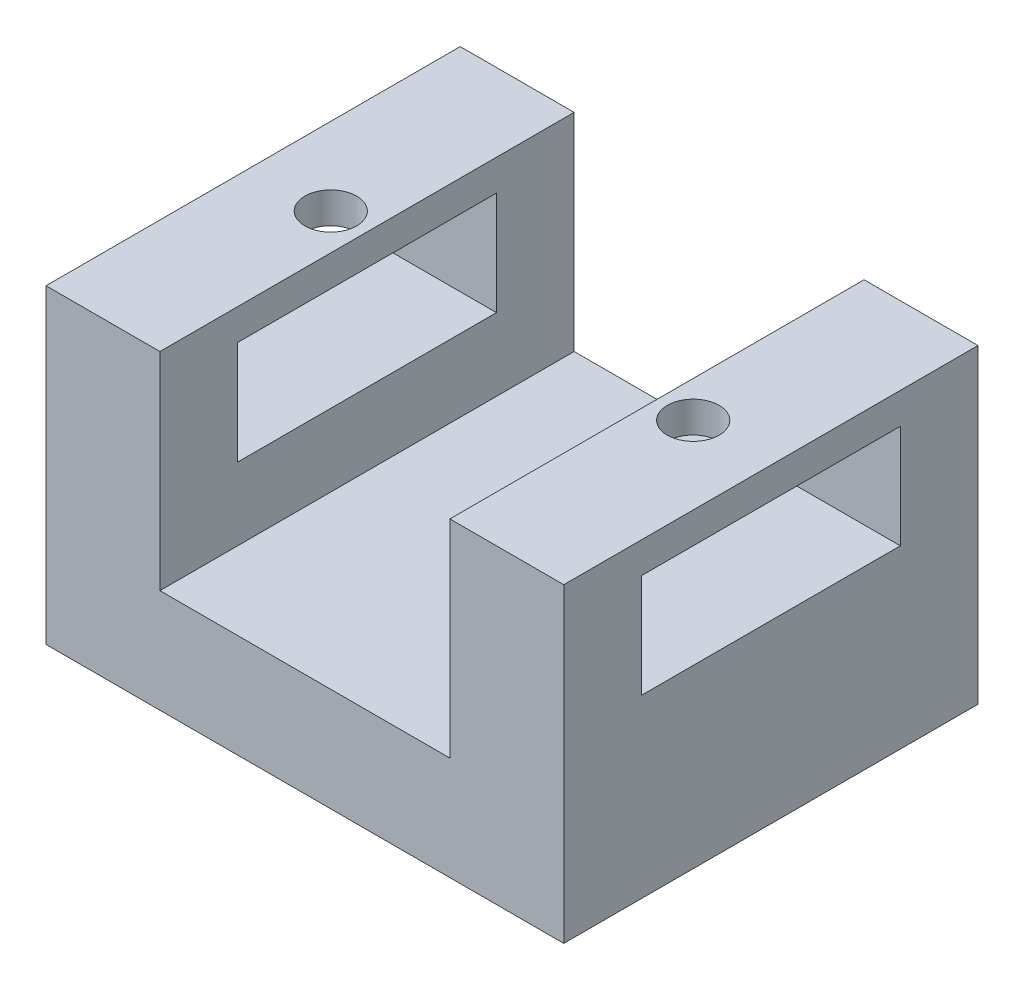
ISO-10303-21;
HEADER;
FILE_DESCRIPTION(('STEP AP214'),'2;1');
FILE_NAME('part.step','',(''),(''),'','','');
FILE_SCHEMA(('AUTOMOTIVE_DESIGN { 1 0 10303 214 1 1 1 1 }'));
ENDSEC;
DATA;
#1=APPLICATION_CONTEXT('core data for automotive mechanical design processes');
#2=APPLICATION_PROTOCOL_DEFINITION('international standard','automotive_design',2000,#1);
#3=PRODUCT_CONTEXT('',#1,'mechanical');
#4=PRODUCT('Part','Part','',(#3));
#5=PRODUCT_RELATED_PRODUCT_CATEGORY('part','',(#4));
#6=PRODUCT_DEFINITION_FORMATION('','',#4);
#7=PRODUCT_DEFINITION_CONTEXT('part definition',#1,'design');
#8=PRODUCT_DEFINITION('design','',#6,#7);
#9=PRODUCT_DEFINITION_SHAPE('','',#8);
#10=(LENGTH_UNIT() NAMED_UNIT(*) SI_UNIT(.MILLI.,.METRE.));
#11=(NAMED_UNIT(*) PLANE_ANGLE_UNIT() SI_UNIT($,.RADIAN.));
#12=(NAMED_UNIT(*) SI_UNIT($,.STERADIAN.) SOLID_ANGLE_UNIT());
#13=UNCERTAINTY_MEASURE_WITH_UNIT(LENGTH_MEASURE(1.E-05),#10,'distance_accuracy_value','');
#14=(GEOMETRIC_REPRESENTATION_CONTEXT(3) GLOBAL_UNCERTAINTY_ASSIGNED_CONTEXT((#13)) GLOBAL_UNIT_ASSIGNED_CONTEXT((#10,
#11,#12)) REPRESENTATION_CONTEXT('',''));
#15=CARTESIAN_POINT('',(0.,0.,0.));
#16=DIRECTION('',(0.,0.,1.));
#17=DIRECTION('',(1.,0.,0.));
#18=AXIS2_PLACEMENT_3D('',#15,#16,#17);
#19=CARTESIAN_POINT('',(0.,10.,0.));
#20=DIRECTION('',(0.,-1.,0.));
#21=DIRECTION('',(0.,0.,-1.));
#22=AXIS2_PLACEMENT_3D('',#19,#20,#21);
#23=PLANE('',#22);
#24=DIRECTION('',(1.,0.,0.));
#25=VECTOR('',#24,1.);
#26=CARTESIAN_POINT('',(0.,10.,0.));
#27=LINE('',#26,#25);
#28=CARTESIAN_POINT('',(11.,10.,0.));
#29=VERTEX_POINT('',#28);
#30=CARTESIAN_POINT('',(39.,10.,0.));
#31=VERTEX_POINT('',#30);
#32=EDGE_CURVE('E287',#29,#31,#27,.T.);
#33=ORIENTED_EDGE('',*,*,#32,.T.);
#34=DIRECTION('',(0.,0.,-1.));
#35=VECTOR('',#34,1.);
#36=CARTESIAN_POINT('',(39.,10.,-40.));
#37=LINE('',#36,#35);
#38=CARTESIAN_POINT('',(39.,10.,-40.));
#39=VERTEX_POINT('',#38);
#40=EDGE_CURVE('E232',#31,#39,#37,.T.);
#41=ORIENTED_EDGE('',*,*,#40,.T.);
#42=DIRECTION('',(-1.,0.,0.));
#43=VECTOR('',#42,1.);
#44=CARTESIAN_POINT('',(0.,10.,-40.));
#45=LINE('',#44,#43);
#46=CARTESIAN_POINT('',(11.,10.,-40.));
#47=VERTEX_POINT('',#46);
#48=EDGE_CURVE('E290',#39,#47,#45,.T.);
#49=ORIENTED_EDGE('',*,*,#48,.T.);
#50=DIRECTION('',(0.,0.,-1.));
#51=VECTOR('',#50,1.);
#52=CARTESIAN_POINT('',(11.,10.,-40.));
#53=LINE('',#52,#51);
#54=EDGE_CURVE('E260',#29,#47,#53,.T.);
#55=ORIENTED_EDGE('',*,*,#54,.F.);
#56=EDGE_LOOP('',(#33,#41,#49,#55));
#57=FACE_BOUND('',#56,.T.);
#58=ADVANCED_FACE('F43',(#57),#23,.F.);
#59=CARTESIAN_POINT('',(0.,10.,0.));
#60=DIRECTION('',(1.,0.,0.));
#61=DIRECTION('',(0.,0.,-1.));
#62=AXIS2_PLACEMENT_3D('',#59,#60,#61);
#63=PLANE('',#62);
#64=DIRECTION('',(0.,0.,1.));
#65=VECTOR('',#64,1.);
#66=CARTESIAN_POINT('',(0.,27.,-7.5));
#67=LINE('',#66,#65);
#68=CARTESIAN_POINT('',(0.,27.,-32.5));
#69=VERTEX_POINT('',#68);
#70=CARTESIAN_POINT('',(0.,27.,-7.5));
#71=VERTEX_POINT('',#70);
#72=EDGE_CURVE('E183',#69,#71,#67,.T.);
#73=ORIENTED_EDGE('',*,*,#72,.T.);
#74=DIRECTION('',(0.,-1.,0.));
#75=VECTOR('',#74,1.);
#76=CARTESIAN_POINT('',(0.,27.,-7.5));
#77=LINE('',#76,#75);
#78=CARTESIAN_POINT('',(0.,17.,-7.5));
#79=VERTEX_POINT('',#78);
#80=EDGE_CURVE('E164',#71,#79,#77,.T.);
#81=ORIENTED_EDGE('',*,*,#80,.T.);
#82=DIRECTION('',(0.,0.,-1.));
#83=VECTOR('',#82,1.);
#84=CARTESIAN_POINT('',(0.,17.,-7.5));
#85=LINE('',#84,#83);
#86=CARTESIAN_POINT('',(0.,17.,-32.5));
#87=VERTEX_POINT('',#86);
#88=EDGE_CURVE('E175',#79,#87,#85,.T.);
#89=ORIENTED_EDGE('',*,*,#88,.T.);
#90=DIRECTION('',(0.,1.,0.));
#91=VECTOR('',#90,1.);
#92=CARTESIAN_POINT('',(0.,27.,-32.5));
#93=LINE('',#92,#91);
#94=EDGE_CURVE('E60',#87,#69,#93,.T.);
#95=ORIENTED_EDGE('',*,*,#94,.T.);
#96=EDGE_LOOP('',(#73,#81,#89,#95));
#97=FACE_BOUND('',#96,.T.);
#98=DIRECTION('',(0.,0.,1.));
#99=VECTOR('',#98,1.);
#100=CARTESIAN_POINT('',(0.,0.,0.));
#101=LINE('',#100,#99);
#102=CARTESIAN_POINT('',(0.,0.,-40.));
#103=VERTEX_POINT('',#102);
#104=CARTESIAN_POINT('',(0.,0.,0.));
#105=VERTEX_POINT('',#104);
#106=EDGE_CURVE('E286',#103,#105,#101,.T.);
#107=ORIENTED_EDGE('',*,*,#106,.T.);
#108=DIRECTION('',(0.,-1.,0.));
#109=VECTOR('',#108,1.);
#110=CARTESIAN_POINT('',(0.,10.,0.));
#111=LINE('',#110,#109);
#112=CARTESIAN_POINT('',(0.,30.,0.));
#113=VERTEX_POINT('',#112);
#114=EDGE_CURVE('E317',#113,#105,#111,.T.);
#115=ORIENTED_EDGE('',*,*,#114,.F.);
#116=DIRECTION('',(0.,0.,1.));
#117=VECTOR('',#116,1.);
#118=CARTESIAN_POINT('',(0.,30.,-40.));
#119=LINE('',#118,#117);
#120=CARTESIAN_POINT('',(0.,30.,-40.));
#121=VERTEX_POINT('',#120);
#122=EDGE_CURVE('E261',#121,#113,#119,.T.);
#123=ORIENTED_EDGE('',*,*,#122,.F.);
#124=DIRECTION('',(0.,-1.,0.));
#125=VECTOR('',#124,1.);
#126=CARTESIAN_POINT('',(0.,10.,-40.));
#127=LINE('',#126,#125);
#128=EDGE_CURVE('E294',#121,#103,#127,.T.);
#129=ORIENTED_EDGE('',*,*,#128,.T.);
#130=EDGE_LOOP('',(#107,#115,#123,#129));
#131=FACE_BOUND('',#130,.T.);
#132=ADVANCED_FACE('F45',(#97,#131),#63,.F.);
#133=CARTESIAN_POINT('',(0.,10.,0.));
#134=DIRECTION('',(0.,0.,-1.));
#135=DIRECTION('',(-1.,0.,0.));
#136=AXIS2_PLACEMENT_3D('',#133,#134,#135);
#137=PLANE('',#136);
#138=DIRECTION('',(1.,0.,0.));
#139=VECTOR('',#138,1.);
#140=CARTESIAN_POINT('',(0.,0.,0.));
#141=LINE('',#140,#139);
#142=CARTESIAN_POINT('',(50.,0.,0.));
#143=VERTEX_POINT('',#142);
#144=EDGE_CURVE('E298',#105,#143,#141,.T.);
#145=ORIENTED_EDGE('',*,*,#144,.T.);
#146=DIRECTION('',(0.,-1.,0.));
#147=VECTOR('',#146,1.);
#148=CARTESIAN_POINT('',(50.,10.,0.));
#149=LINE('',#148,#147);
#150=CARTESIAN_POINT('',(50.,30.,0.));
#151=VERTEX_POINT('',#150);
#152=EDGE_CURVE('E313',#151,#143,#149,.T.);
#153=ORIENTED_EDGE('',*,*,#152,.F.);
#154=DIRECTION('',(-1.,0.,0.));
#155=VECTOR('',#154,1.);
#156=CARTESIAN_POINT('',(50.,30.,0.));
#157=LINE('',#156,#155);
#158=CARTESIAN_POINT('',(39.,30.,0.));
#159=VERTEX_POINT('',#158);
#160=EDGE_CURVE('E245',#151,#159,#157,.T.);
#161=ORIENTED_EDGE('',*,*,#160,.T.);
#162=DIRECTION('',(0.,-1.,0.));
#163=VECTOR('',#162,1.);
#164=CARTESIAN_POINT('',(39.,30.,0.));
#165=LINE('',#164,#163);
#166=EDGE_CURVE('E249',#159,#31,#165,.T.);
#167=ORIENTED_EDGE('',*,*,#166,.T.);
#168=ORIENTED_EDGE('',*,*,#32,.F.);
#169=DIRECTION('',(0.,-1.,0.));
#170=VECTOR('',#169,1.);
#171=CARTESIAN_POINT('',(11.,30.,0.));
#172=LINE('',#171,#170);
#173=CARTESIAN_POINT('',(11.,30.,0.));
#174=VERTEX_POINT('',#173);
#175=EDGE_CURVE('E282',#174,#29,#172,.T.);
#176=ORIENTED_EDGE('',*,*,#175,.F.);
#177=DIRECTION('',(1.,0.,0.));
#178=VECTOR('',#177,1.);
#179=CARTESIAN_POINT('',(0.,30.,0.));
#180=LINE('',#179,#178);
#181=EDGE_CURVE('E265',#113,#174,#180,.T.);
#182=ORIENTED_EDGE('',*,*,#181,.F.);
#183=ORIENTED_EDGE('',*,*,#114,.T.);
#184=EDGE_LOOP('',(#145,#153,#161,#167,#168,#176,#182,#183));
#185=FACE_BOUND('',#184,.T.);
#186=ADVANCED_FACE('F357',(#185),#137,.F.);
#187=CARTESIAN_POINT('',(50.,10.,0.));
#188=DIRECTION('',(-1.,0.,0.));
#189=DIRECTION('',(0.,0.,1.));
#190=AXIS2_PLACEMENT_3D('',#187,#188,#189);
#191=PLANE('',#190);
#192=DIRECTION('',(0.,0.,-1.));
#193=VECTOR('',#192,1.);
#194=CARTESIAN_POINT('',(50.,17.,-7.5));
#195=LINE('',#194,#193);
#196=CARTESIAN_POINT('',(50.,17.,-7.5));
#197=VERTEX_POINT('',#196);
#198=CARTESIAN_POINT('',(50.,17.,-32.5));
#199=VERTEX_POINT('',#198);
#200=EDGE_CURVE('E201',#197,#199,#195,.T.);
#201=ORIENTED_EDGE('',*,*,#200,.F.);
#202=DIRECTION('',(0.,-1.,0.));
#203=VECTOR('',#202,1.);
#204=CARTESIAN_POINT('',(50.,27.,-7.5));
#205=LINE('',#204,#203);
#206=CARTESIAN_POINT('',(50.,27.,-7.5));
#207=VERTEX_POINT('',#206);
#208=EDGE_CURVE('E68',#207,#197,#205,.T.);
#209=ORIENTED_EDGE('',*,*,#208,.F.);
#210=DIRECTION('',(0.,0.,1.));
#211=VECTOR('',#210,1.);
#212=CARTESIAN_POINT('',(50.,27.,-7.5));
#213=LINE('',#212,#211);
#214=CARTESIAN_POINT('',(50.,27.,-32.5));
#215=VERTEX_POINT('',#214);
#216=EDGE_CURVE('E185',#215,#207,#213,.T.);
#217=ORIENTED_EDGE('',*,*,#216,.F.);
#218=DIRECTION('',(0.,1.,0.));
#219=VECTOR('',#218,1.);
#220=CARTESIAN_POINT('',(50.,27.,-32.5));
#221=LINE('',#220,#219);
#222=EDGE_CURVE('E189',#199,#215,#221,.T.);
#223=ORIENTED_EDGE('',*,*,#222,.F.);
#224=EDGE_LOOP('',(#201,#209,#217,#223));
#225=FACE_BOUND('',#224,.T.);
#226=DIRECTION('',(0.,0.,-1.));
#227=VECTOR('',#226,1.);
#228=CARTESIAN_POINT('',(50.,0.,0.));
#229=LINE('',#228,#227);
#230=CARTESIAN_POINT('',(50.,0.,-40.));
#231=VERTEX_POINT('',#230);
#232=EDGE_CURVE('E301',#143,#231,#229,.T.);
#233=ORIENTED_EDGE('',*,*,#232,.T.);
#234=DIRECTION('',(0.,-1.,0.));
#235=VECTOR('',#234,1.);
#236=CARTESIAN_POINT('',(50.,10.,-40.));
#237=LINE('',#236,#235);
#238=CARTESIAN_POINT('',(50.,30.,-40.));
#239=VERTEX_POINT('',#238);
#240=EDGE_CURVE('E309',#239,#231,#237,.T.);
#241=ORIENTED_EDGE('',*,*,#240,.F.);
#242=DIRECTION('',(0.,0.,1.));
#243=VECTOR('',#242,1.);
#244=CARTESIAN_POINT('',(50.,30.,-40.));
#245=LINE('',#244,#243);
#246=EDGE_CURVE('E233',#239,#151,#245,.T.);
#247=ORIENTED_EDGE('',*,*,#246,.T.);
#248=ORIENTED_EDGE('',*,*,#152,.T.);
#249=EDGE_LOOP('',(#233,#241,#247,#248));
#250=FACE_BOUND('',#249,.T.);
#251=ADVANCED_FACE('F353',(#225,#250),#191,.F.);
#252=CARTESIAN_POINT('',(0.,10.,-40.));
#253=DIRECTION('',(0.,0.,1.));
#254=DIRECTION('',(1.,0.,0.));
#255=AXIS2_PLACEMENT_3D('',#252,#253,#254);
#256=PLANE('',#255);
#257=DIRECTION('',(-1.,0.,0.));
#258=VECTOR('',#257,1.);
#259=CARTESIAN_POINT('',(0.,0.,-40.));
#260=LINE('',#259,#258);
#261=EDGE_CURVE('E291',#231,#103,#260,.T.);
#262=ORIENTED_EDGE('',*,*,#261,.T.);
#263=ORIENTED_EDGE('',*,*,#128,.F.);
#264=DIRECTION('',(-1.,0.,0.));
#265=VECTOR('',#264,1.);
#266=CARTESIAN_POINT('',(0.,30.,-40.));
#267=LINE('',#266,#265);
#268=CARTESIAN_POINT('',(11.,30.,-40.));
#269=VERTEX_POINT('',#268);
#270=EDGE_CURVE('E271',#269,#121,#267,.T.);
#271=ORIENTED_EDGE('',*,*,#270,.F.);
#272=DIRECTION('',(0.,-1.,0.));
#273=VECTOR('',#272,1.);
#274=CARTESIAN_POINT('',(11.,30.,-40.));
#275=LINE('',#274,#273);
#276=EDGE_CURVE('E275',#269,#47,#275,.T.);
#277=ORIENTED_EDGE('',*,*,#276,.T.);
#278=ORIENTED_EDGE('',*,*,#48,.F.);
#279=DIRECTION('',(0.,-1.,0.));
#280=VECTOR('',#279,1.);
#281=CARTESIAN_POINT('',(39.,30.,-40.));
#282=LINE('',#281,#280);
#283=CARTESIAN_POINT('',(39.,30.,-40.));
#284=VERTEX_POINT('',#283);
#285=EDGE_CURVE('E256',#284,#39,#282,.T.);
#286=ORIENTED_EDGE('',*,*,#285,.F.);
#287=DIRECTION('',(1.,0.,0.));
#288=VECTOR('',#287,1.);
#289=CARTESIAN_POINT('',(50.,30.,-40.));
#290=LINE('',#289,#288);
#291=EDGE_CURVE('E237',#284,#239,#290,.T.);
#292=ORIENTED_EDGE('',*,*,#291,.T.);
#293=ORIENTED_EDGE('',*,*,#240,.T.);
#294=EDGE_LOOP('',(#262,#263,#271,#277,#278,#286,#292,#293));
#295=FACE_BOUND('',#294,.T.);
#296=ADVANCED_FACE('F356',(#295),#256,.F.);
#297=CARTESIAN_POINT('',(0.,0.,0.));
#298=DIRECTION('',(0.,-1.,0.));
#299=DIRECTION('',(0.,0.,-1.));
#300=AXIS2_PLACEMENT_3D('',#297,#298,#299);
#301=PLANE('',#300);
#302=ORIENTED_EDGE('',*,*,#106,.F.);
#303=ORIENTED_EDGE('',*,*,#261,.F.);
#304=ORIENTED_EDGE('',*,*,#232,.F.);
#305=ORIENTED_EDGE('',*,*,#144,.F.);
#306=EDGE_LOOP('',(#302,#303,#304,#305));
#307=FACE_BOUND('',#306,.T.);
#308=ADVANCED_FACE('F366',(#307),#301,.T.);
#309=CARTESIAN_POINT('',(11.,30.,-40.));
#310=DIRECTION('',(-1.,0.,0.));
#311=DIRECTION('',(0.,0.,1.));
#312=AXIS2_PLACEMENT_3D('',#309,#310,#311);
#313=PLANE('',#312);
#314=DIRECTION('',(0.,0.,1.));
#315=VECTOR('',#314,1.);
#316=CARTESIAN_POINT('',(11.,17.,-40.));
#317=LINE('',#316,#315);
#318=CARTESIAN_POINT('',(11.,17.,-32.5));
#319=VERTEX_POINT('',#318);
#320=CARTESIAN_POINT('',(11.,17.,-7.5));
#321=VERTEX_POINT('',#320);
#322=EDGE_CURVE('E211',#319,#321,#317,.T.);
#323=ORIENTED_EDGE('',*,*,#322,.T.);
#324=DIRECTION('',(0.,1.,0.));
#325=VECTOR('',#324,1.);
#326=CARTESIAN_POINT('',(11.,30.,-7.5));
#327=LINE('',#326,#325);
#328=CARTESIAN_POINT('',(11.,27.,-7.5));
#329=VERTEX_POINT('',#328);
#330=EDGE_CURVE('E167',#321,#329,#327,.T.);
#331=ORIENTED_EDGE('',*,*,#330,.T.);
#332=DIRECTION('',(0.,0.,-1.));
#333=VECTOR('',#332,1.);
#334=CARTESIAN_POINT('',(11.,27.,-40.));
#335=LINE('',#334,#333);
#336=CARTESIAN_POINT('',(11.,27.,-32.5));
#337=VERTEX_POINT('',#336);
#338=EDGE_CURVE('E226',#329,#337,#335,.T.);
#339=ORIENTED_EDGE('',*,*,#338,.T.);
#340=DIRECTION('',(0.,-1.,0.));
#341=VECTOR('',#340,1.);
#342=CARTESIAN_POINT('',(11.,30.,-32.5));
#343=LINE('',#342,#341);
#344=EDGE_CURVE('E222',#337,#319,#343,.T.);
#345=ORIENTED_EDGE('',*,*,#344,.T.);
#346=EDGE_LOOP('',(#323,#331,#339,#345));
#347=FACE_BOUND('',#346,.T.);
#348=ORIENTED_EDGE('',*,*,#54,.T.);
#349=ORIENTED_EDGE('',*,*,#276,.F.);
#350=DIRECTION('',(0.,0.,-1.));
#351=VECTOR('',#350,1.);
#352=CARTESIAN_POINT('',(11.,30.,-40.));
#353=LINE('',#352,#351);
#354=EDGE_CURVE('E268',#174,#269,#353,.T.);
#355=ORIENTED_EDGE('',*,*,#354,.F.);
#356=ORIENTED_EDGE('',*,*,#175,.T.);
#357=EDGE_LOOP('',(#348,#349,#355,#356));
#358=FACE_BOUND('',#357,.T.);
#359=ADVANCED_FACE('F376',(#347,#358),#313,.F.);
#360=CARTESIAN_POINT('',(0.,30.,0.));
#361=DIRECTION('',(0.,1.,0.));
#362=DIRECTION('',(0.,0.,1.));
#363=AXIS2_PLACEMENT_3D('',#360,#361,#362);
#364=PLANE('',#363);
#365=CARTESIAN_POINT('',(7.5,30.,-20.));
#366=DIRECTION('',(0.,1.,0.));
#367=DIRECTION('',(0.,0.,1.));
#368=AXIS2_PLACEMENT_3D('',#365,#366,#367);
#369=CIRCLE('',#368,2.5);
#370=CARTESIAN_POINT('',(7.5,30.,-17.5));
#371=VERTEX_POINT('',#370);
#372=EDGE_CURVE('E613',#371,#371,#369,.T.);
#373=ORIENTED_EDGE('',*,*,#372,.F.);
#374=EDGE_LOOP('',(#373));
#375=FACE_BOUND('',#374,.T.);
#376=ORIENTED_EDGE('',*,*,#122,.T.);
#377=ORIENTED_EDGE('',*,*,#181,.T.);
#378=ORIENTED_EDGE('',*,*,#354,.T.);
#379=ORIENTED_EDGE('',*,*,#270,.T.);
#380=EDGE_LOOP('',(#376,#377,#378,#379));
#381=FACE_BOUND('',#380,.T.);
#382=ADVANCED_FACE('F371',(#375,#381),#364,.T.);
#383=CARTESIAN_POINT('',(39.,30.,-40.));
#384=DIRECTION('',(-1.,0.,0.));
#385=DIRECTION('',(0.,0.,1.));
#386=AXIS2_PLACEMENT_3D('',#383,#384,#385);
#387=PLANE('',#386);
#388=DIRECTION('',(0.,1.,0.));
#389=VECTOR('',#388,1.);
#390=CARTESIAN_POINT('',(39.,30.,-7.5));
#391=LINE('',#390,#389);
#392=CARTESIAN_POINT('',(39.,17.,-7.5));
#393=VERTEX_POINT('',#392);
#394=CARTESIAN_POINT('',(39.,27.,-7.5));
#395=VERTEX_POINT('',#394);
#396=EDGE_CURVE('E11',#393,#395,#391,.T.);
#397=ORIENTED_EDGE('',*,*,#396,.F.);
#398=DIRECTION('',(0.,0.,1.));
#399=VECTOR('',#398,1.);
#400=CARTESIAN_POINT('',(39.,17.,-40.));
#401=LINE('',#400,#399);
#402=CARTESIAN_POINT('',(39.,17.,-32.5));
#403=VERTEX_POINT('',#402);
#404=EDGE_CURVE('E321',#403,#393,#401,.T.);
#405=ORIENTED_EDGE('',*,*,#404,.F.);
#406=DIRECTION('',(0.,-1.,0.));
#407=VECTOR('',#406,1.);
#408=CARTESIAN_POINT('',(39.,30.,-32.5));
#409=LINE('',#408,#407);
#410=CARTESIAN_POINT('',(39.,27.,-32.5));
#411=VERTEX_POINT('',#410);
#412=EDGE_CURVE('E324',#411,#403,#409,.T.);
#413=ORIENTED_EDGE('',*,*,#412,.F.);
#414=DIRECTION('',(0.,0.,-1.));
#415=VECTOR('',#414,1.);
#416=CARTESIAN_POINT('',(39.,27.,-40.));
#417=LINE('',#416,#415);
#418=EDGE_CURVE('E53',#395,#411,#417,.T.);
#419=ORIENTED_EDGE('',*,*,#418,.F.);
#420=EDGE_LOOP('',(#397,#405,#413,#419));
#421=FACE_BOUND('',#420,.T.);
#422=ORIENTED_EDGE('',*,*,#40,.F.);
#423=ORIENTED_EDGE('',*,*,#166,.F.);
#424=DIRECTION('',(0.,0.,-1.));
#425=VECTOR('',#424,1.);
#426=CARTESIAN_POINT('',(39.,30.,-40.));
#427=LINE('',#426,#425);
#428=EDGE_CURVE('E241',#159,#284,#427,.T.);
#429=ORIENTED_EDGE('',*,*,#428,.T.);
#430=ORIENTED_EDGE('',*,*,#285,.T.);
#431=EDGE_LOOP('',(#422,#423,#429,#430));
#432=FACE_BOUND('',#431,.T.);
#433=ADVANCED_FACE('F343',(#421,#432),#387,.T.);
#434=CARTESIAN_POINT('',(50.,30.,0.));
#435=DIRECTION('',(0.,1.,0.));
#436=DIRECTION('',(0.,0.,1.));
#437=AXIS2_PLACEMENT_3D('',#434,#435,#436);
#438=PLANE('',#437);
#439=CARTESIAN_POINT('',(42.5,30.,-20.));
#440=DIRECTION('',(0.,-1.,0.));
#441=DIRECTION('',(0.,0.,1.));
#442=AXIS2_PLACEMENT_3D('',#439,#440,#441);
#443=CIRCLE('',#442,2.5);
#444=CARTESIAN_POINT('',(42.5,30.,-17.5));
#445=VERTEX_POINT('',#444);
#446=EDGE_CURVE('E609',#445,#445,#443,.T.);
#447=ORIENTED_EDGE('',*,*,#446,.T.);
#448=EDGE_LOOP('',(#447));
#449=FACE_BOUND('',#448,.T.);
#450=ORIENTED_EDGE('',*,*,#246,.F.);
#451=ORIENTED_EDGE('',*,*,#291,.F.);
#452=ORIENTED_EDGE('',*,*,#428,.F.);
#453=ORIENTED_EDGE('',*,*,#160,.F.);
#454=EDGE_LOOP('',(#450,#451,#452,#453));
#455=FACE_BOUND('',#454,.T.);
#456=ADVANCED_FACE('F383',(#449,#455),#438,.T.);
#457=CARTESIAN_POINT('',(0.,17.,-7.5));
#458=DIRECTION('',(0.,-1.,0.));
#459=DIRECTION('',(0.,0.,-1.));
#460=AXIS2_PLACEMENT_3D('',#457,#458,#459);
#461=PLANE('',#460);
#462=ORIENTED_EDGE('',*,*,#404,.T.);
#463=DIRECTION('',(1.,0.,0.));
#464=VECTOR('',#463,1.);
#465=CARTESIAN_POINT('',(0.,17.,-7.5));
#466=LINE('',#465,#464);
#467=EDGE_CURVE('E172',#393,#197,#466,.T.);
#468=ORIENTED_EDGE('',*,*,#467,.T.);
#469=ORIENTED_EDGE('',*,*,#200,.T.);
#470=DIRECTION('',(1.,0.,0.));
#471=VECTOR('',#470,1.);
#472=CARTESIAN_POINT('',(0.,17.,-32.5));
#473=LINE('',#472,#471);
#474=EDGE_CURVE('E171',#403,#199,#473,.T.);
#475=ORIENTED_EDGE('',*,*,#474,.F.);
#476=EDGE_LOOP('',(#462,#468,#469,#475));
#477=FACE_BOUND('',#476,.T.);
#478=ADVANCED_FACE('F346',(#477),#461,.F.);
#479=CARTESIAN_POINT('',(0.,27.,-32.5));
#480=DIRECTION('',(0.,0.,-1.));
#481=DIRECTION('',(-1.,0.,0.));
#482=AXIS2_PLACEMENT_3D('',#479,#480,#481);
#483=PLANE('',#482);
#484=ORIENTED_EDGE('',*,*,#412,.T.);
#485=ORIENTED_EDGE('',*,*,#474,.T.);
#486=ORIENTED_EDGE('',*,*,#222,.T.);
#487=DIRECTION('',(1.,0.,0.));
#488=VECTOR('',#487,1.);
#489=CARTESIAN_POINT('',(0.,27.,-32.5));
#490=LINE('',#489,#488);
#491=EDGE_CURVE('E217',#411,#215,#490,.T.);
#492=ORIENTED_EDGE('',*,*,#491,.F.);
#493=EDGE_LOOP('',(#484,#485,#486,#492));
#494=FACE_BOUND('',#493,.T.);
#495=ADVANCED_FACE('F338',(#494),#483,.F.);
#496=CARTESIAN_POINT('',(0.,27.,-7.5));
#497=DIRECTION('',(0.,1.,0.));
#498=DIRECTION('',(0.,0.,1.));
#499=AXIS2_PLACEMENT_3D('',#496,#497,#498);
#500=PLANE('',#499);
#501=CARTESIAN_POINT('',(42.5,27.,-20.));
#502=DIRECTION('',(0.,1.,0.));
#503=DIRECTION('',(0.,0.,1.));
#504=AXIS2_PLACEMENT_3D('',#501,#502,#503);
#505=CIRCLE('',#504,2.5);
#506=CARTESIAN_POINT('',(42.5,27.,-17.5));
#507=VERTEX_POINT('',#506);
#508=EDGE_CURVE('E47',#507,#507,#505,.F.);
#509=ORIENTED_EDGE('',*,*,#508,.F.);
#510=EDGE_LOOP('',(#509));
#511=FACE_BOUND('',#510,.T.);
#512=ORIENTED_EDGE('',*,*,#418,.T.);
#513=ORIENTED_EDGE('',*,*,#491,.T.);
#514=ORIENTED_EDGE('',*,*,#216,.T.);
#515=DIRECTION('',(1.,0.,0.));
#516=VECTOR('',#515,1.);
#517=CARTESIAN_POINT('',(0.,27.,-7.5));
#518=LINE('',#517,#516);
#519=EDGE_CURVE('E212',#395,#207,#518,.T.);
#520=ORIENTED_EDGE('',*,*,#519,.F.);
#521=EDGE_LOOP('',(#512,#513,#514,#520));
#522=FACE_BOUND('',#521,.T.);
#523=ADVANCED_FACE('F333',(#511,#522),#500,.F.);
#524=CARTESIAN_POINT('',(0.,27.,-7.5));
#525=DIRECTION('',(0.,0.,1.));
#526=DIRECTION('',(0.,-1.,0.));
#527=AXIS2_PLACEMENT_3D('',#524,#525,#526);
#528=PLANE('',#527);
#529=ORIENTED_EDGE('',*,*,#396,.T.);
#530=ORIENTED_EDGE('',*,*,#519,.T.);
#531=ORIENTED_EDGE('',*,*,#208,.T.);
#532=ORIENTED_EDGE('',*,*,#467,.F.);
#533=EDGE_LOOP('',(#529,#530,#531,#532));
#534=FACE_BOUND('',#533,.T.);
#535=ADVANCED_FACE('F348',(#534),#528,.F.);
#536=EDGE_CURVE('E159',#79,#321,#466,.T.);
#537=ORIENTED_EDGE('',*,*,#536,.F.);
#538=ORIENTED_EDGE('',*,*,#80,.F.);
#539=EDGE_CURVE('E208',#71,#329,#518,.T.);
#540=ORIENTED_EDGE('',*,*,#539,.T.);
#541=ORIENTED_EDGE('',*,*,#330,.F.);
#542=EDGE_LOOP('',(#537,#538,#540,#541));
#543=FACE_BOUND('',#542,.T.);
#544=ADVANCED_FACE('F161',(#543),#528,.F.);
#545=CARTESIAN_POINT('',(7.5,27.,-20.));
#546=DIRECTION('',(0.,1.,0.));
#547=DIRECTION('',(0.,0.,1.));
#548=AXIS2_PLACEMENT_3D('',#545,#546,#547);
#549=CIRCLE('',#548,2.5);
#550=CARTESIAN_POINT('',(7.5,27.,-17.5));
#551=VERTEX_POINT('',#550);
#552=EDGE_CURVE('E192',#551,#551,#549,.T.);
#553=ORIENTED_EDGE('',*,*,#552,.T.);
#554=EDGE_LOOP('',(#553));
#555=FACE_BOUND('',#554,.T.);
#556=ORIENTED_EDGE('',*,*,#539,.F.);
#557=ORIENTED_EDGE('',*,*,#72,.F.);
#558=EDGE_CURVE('E213',#69,#337,#490,.T.);
#559=ORIENTED_EDGE('',*,*,#558,.T.);
#560=ORIENTED_EDGE('',*,*,#338,.F.);
#561=EDGE_LOOP('',(#556,#557,#559,#560));
#562=FACE_BOUND('',#561,.T.);
#563=ADVANCED_FACE('F458',(#555,#562),#500,.F.);
#564=ORIENTED_EDGE('',*,*,#558,.F.);
#565=ORIENTED_EDGE('',*,*,#94,.F.);
#566=EDGE_CURVE('E177',#87,#319,#473,.T.);
#567=ORIENTED_EDGE('',*,*,#566,.T.);
#568=ORIENTED_EDGE('',*,*,#344,.F.);
#569=EDGE_LOOP('',(#564,#565,#567,#568));
#570=FACE_BOUND('',#569,.T.);
#571=ADVANCED_FACE('F450',(#570),#483,.F.);
#572=ORIENTED_EDGE('',*,*,#566,.F.);
#573=ORIENTED_EDGE('',*,*,#88,.F.);
#574=ORIENTED_EDGE('',*,*,#536,.T.);
#575=ORIENTED_EDGE('',*,*,#322,.F.);
#576=EDGE_LOOP('',(#572,#573,#574,#575));
#577=FACE_BOUND('',#576,.T.);
#578=ADVANCED_FACE('F176',(#577),#461,.F.);
#579=CARTESIAN_POINT('',(7.5,9.92893218813453,-20.));
#580=DIRECTION('',(0.,1.,0.));
#581=DIRECTION('',(0.,0.,1.));
#582=AXIS2_PLACEMENT_3D('',#579,#580,#581);
#583=CYLINDRICAL_SURFACE('',#582,2.5);
#584=ORIENTED_EDGE('',*,*,#372,.T.);
#585=EDGE_LOOP('',(#584));
#586=FACE_BOUND('',#585,.T.);
#587=ORIENTED_EDGE('',*,*,#552,.F.);
#588=EDGE_LOOP('',(#587));
#589=FACE_BOUND('',#588,.T.);
#590=ADVANCED_FACE('F484',(#586,#589),#583,.F.);
#591=CARTESIAN_POINT('',(42.5,9.92893218813452,-20.));
#592=DIRECTION('',(0.,1.,0.));
#593=DIRECTION('',(0.,0.,1.));
#594=AXIS2_PLACEMENT_3D('',#591,#592,#593);
#595=CYLINDRICAL_SURFACE('',#594,2.5);
#596=ORIENTED_EDGE('',*,*,#446,.F.);
#597=EDGE_LOOP('',(#596));
#598=FACE_BOUND('',#597,.T.);
#599=ORIENTED_EDGE('',*,*,#508,.T.);
#600=EDGE_LOOP('',(#599));
#601=FACE_BOUND('',#600,.T.);
#602=ADVANCED_FACE('F489',(#598,#601),#595,.F.);
#603=CLOSED_SHELL('',(#58,#132,#186,#251,#296,#308,#359,#382,#433,#456,#478,#495,#523,#535,#544,
#563,#571,#578,#590,#602));
#604=MANIFOLD_SOLID_BREP('B2',#603);
#605=ADVANCED_BREP_SHAPE_REPRESENTATION('',(#18,#604),#14);
#606=SHAPE_DEFINITION_REPRESENTATION(#9,#605);
ENDSEC;
END-ISO-10303-21;
